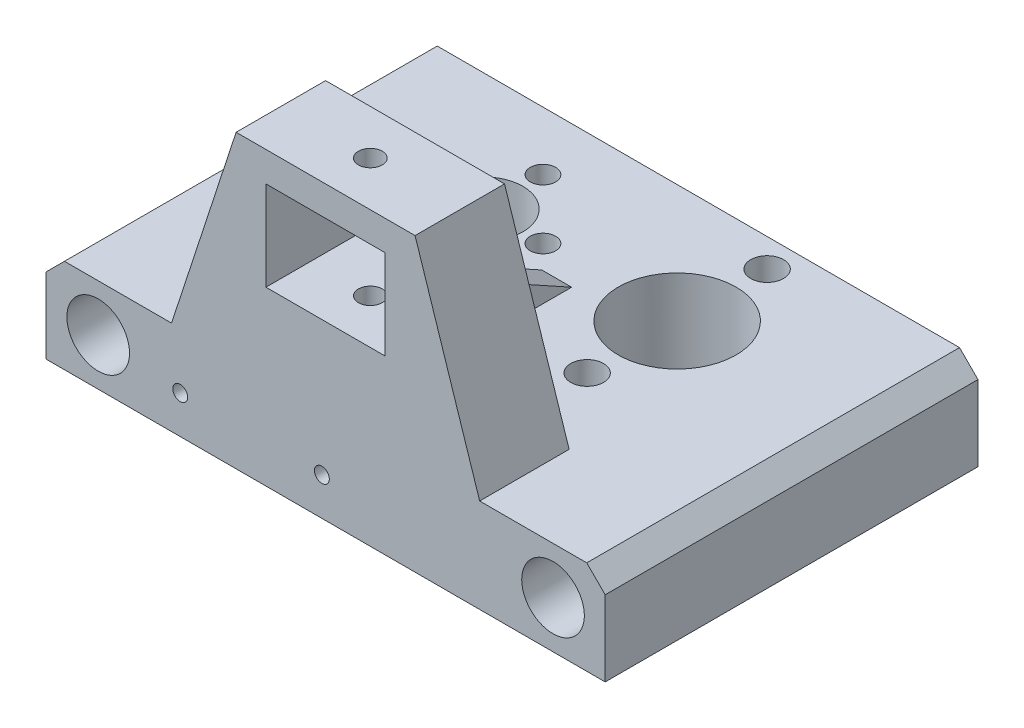
ISO-10303-21;
HEADER;
FILE_DESCRIPTION(('STEP AP214'),'2;1');
FILE_NAME('part.step','',(''),(''),'','','');
FILE_SCHEMA(('AUTOMOTIVE_DESIGN { 1 0 10303 214 1 1 1 1 }'));
ENDSEC;
DATA;
#1=APPLICATION_CONTEXT('core data for automotive mechanical design processes');
#2=APPLICATION_PROTOCOL_DEFINITION('international standard','automotive_design',2000,#1);
#3=PRODUCT_CONTEXT('',#1,'mechanical');
#4=PRODUCT('Part','Part','',(#3));
#5=PRODUCT_RELATED_PRODUCT_CATEGORY('part','',(#4));
#6=PRODUCT_DEFINITION_FORMATION('','',#4);
#7=PRODUCT_DEFINITION_CONTEXT('part definition',#1,'design');
#8=PRODUCT_DEFINITION('design','',#6,#7);
#9=PRODUCT_DEFINITION_SHAPE('','',#8);
#10=(LENGTH_UNIT() NAMED_UNIT(*) SI_UNIT(.MILLI.,.METRE.));
#11=(NAMED_UNIT(*) PLANE_ANGLE_UNIT() SI_UNIT($,.RADIAN.));
#12=(NAMED_UNIT(*) SI_UNIT($,.STERADIAN.) SOLID_ANGLE_UNIT());
#13=UNCERTAINTY_MEASURE_WITH_UNIT(LENGTH_MEASURE(1.E-05),#10,'distance_accuracy_value','');
#14=(GEOMETRIC_REPRESENTATION_CONTEXT(3) GLOBAL_UNCERTAINTY_ASSIGNED_CONTEXT((#13)) GLOBAL_UNIT_ASSIGNED_CONTEXT((#10,
#11,#12)) REPRESENTATION_CONTEXT('',''));
#15=CARTESIAN_POINT('',(0.,0.,0.));
#16=DIRECTION('',(0.,0.,1.));
#17=DIRECTION('',(1.,0.,0.));
#18=AXIS2_PLACEMENT_3D('',#15,#16,#17);
#19=CARTESIAN_POINT('',(35.5,2.1,-12.));
#20=DIRECTION('',(1.,0.,0.));
#21=DIRECTION('',(0.,0.,-1.));
#22=AXIS2_PLACEMENT_3D('',#19,#20,#21);
#23=PLANE('',#22);
#24=DIRECTION('',(0.,0.,-1.));
#25=VECTOR('',#24,1.);
#26=CARTESIAN_POINT('',(35.5,12.6,-12.));
#27=LINE('',#26,#25);
#28=CARTESIAN_POINT('',(35.5,12.6,-12.));
#29=VERTEX_POINT('',#28);
#30=CARTESIAN_POINT('',(35.5,12.6,-31.));
#31=VERTEX_POINT('',#30);
#32=EDGE_CURVE('E194',#29,#31,#27,.T.);
#33=ORIENTED_EDGE('',*,*,#32,.F.);
#34=DIRECTION('',(0.,-1.,0.));
#35=VECTOR('',#34,1.);
#36=CARTESIAN_POINT('',(35.5,2.1,-12.));
#37=LINE('',#36,#35);
#38=CARTESIAN_POINT('',(35.5,23.1,-12.));
#39=VERTEX_POINT('',#38);
#40=EDGE_CURVE('E212',#39,#29,#37,.T.);
#41=ORIENTED_EDGE('',*,*,#40,.F.);
#42=DIRECTION('',(0.,-0.483686111690123,-0.87524153543927));
#43=VECTOR('',#42,1.);
#44=CARTESIAN_POINT('',(35.5,23.1,-12.));
#45=LINE('',#44,#43);
#46=EDGE_CURVE('E202',#39,#31,#45,.T.);
#47=ORIENTED_EDGE('',*,*,#46,.T.);
#48=EDGE_LOOP('',(#33,#41,#47));
#49=FACE_BOUND('',#48,.T.);
#50=ADVANCED_FACE('F34',(#49),#23,.F.);
#51=CARTESIAN_POINT('',(45.5,35.1,-12.));
#52=DIRECTION('',(0.,0.,1.));
#53=DIRECTION('',(1.,0.,0.));
#54=AXIS2_PLACEMENT_3D('',#51,#52,#53);
#55=PLANE('',#54);
#56=DIRECTION('',(1.,0.,0.));
#57=VECTOR('',#56,1.);
#58=CARTESIAN_POINT('',(45.5,12.6,-12.));
#59=LINE('',#58,#57);
#60=CARTESIAN_POINT('',(16.8365384615385,12.6,-12.));
#61=VERTEX_POINT('',#60);
#62=EDGE_CURVE('E195',#61,#29,#59,.T.);
#63=ORIENTED_EDGE('',*,*,#62,.F.);
#64=DIRECTION('',(0.310738856307423,0.950495325175645,0.));
#65=VECTOR('',#64,1.);
#66=CARTESIAN_POINT('',(25.5,39.1,-12.));
#67=LINE('',#66,#65);
#68=CARTESIAN_POINT('',(25.5,39.1,-12.));
#69=VERTEX_POINT('',#68);
#70=EDGE_CURVE('E226',#61,#69,#67,.T.);
#71=ORIENTED_EDGE('',*,*,#70,.T.);
#72=DIRECTION('',(1.,0.,0.));
#73=VECTOR('',#72,1.);
#74=CARTESIAN_POINT('',(49.5,39.1,-12.));
#75=LINE('',#74,#73);
#76=CARTESIAN_POINT('',(49.5,39.1,-12.));
#77=VERTEX_POINT('',#76);
#78=EDGE_CURVE('E271',#69,#77,#75,.T.);
#79=ORIENTED_EDGE('',*,*,#78,.T.);
#80=DIRECTION('',(0.310738856307423,-0.950495325175645,0.));
#81=VECTOR('',#80,1.);
#82=CARTESIAN_POINT('',(49.5,39.1,-12.));
#83=LINE('',#82,#81);
#84=CARTESIAN_POINT('',(58.1634615384615,12.6,-12.));
#85=VERTEX_POINT('',#84);
#86=EDGE_CURVE('E231',#77,#85,#83,.T.);
#87=ORIENTED_EDGE('',*,*,#86,.T.);
#88=CARTESIAN_POINT('',(39.5,12.6,-12.));
#89=VERTEX_POINT('',#88);
#90=EDGE_CURVE('E192',#89,#85,#59,.T.);
#91=ORIENTED_EDGE('',*,*,#90,.F.);
#92=DIRECTION('',(0.,-1.,0.));
#93=VECTOR('',#92,1.);
#94=CARTESIAN_POINT('',(39.5,2.1,-12.));
#95=LINE('',#94,#93);
#96=CARTESIAN_POINT('',(39.5,23.1,-12.));
#97=VERTEX_POINT('',#96);
#98=EDGE_CURVE('E205',#97,#89,#95,.T.);
#99=ORIENTED_EDGE('',*,*,#98,.F.);
#100=DIRECTION('',(-1.,0.,0.));
#101=VECTOR('',#100,1.);
#102=CARTESIAN_POINT('',(45.5,23.1,-12.));
#103=LINE('',#102,#101);
#104=CARTESIAN_POINT('',(45.5,23.1,-12.));
#105=VERTEX_POINT('',#104);
#106=EDGE_CURVE('E239',#105,#97,#103,.T.);
#107=ORIENTED_EDGE('',*,*,#106,.F.);
#108=DIRECTION('',(0.,-1.,0.));
#109=VECTOR('',#108,1.);
#110=CARTESIAN_POINT('',(45.5,35.1,-12.));
#111=LINE('',#110,#109);
#112=CARTESIAN_POINT('',(45.5,35.1,-12.));
#113=VERTEX_POINT('',#112);
#114=EDGE_CURVE('E293',#113,#105,#111,.T.);
#115=ORIENTED_EDGE('',*,*,#114,.F.);
#116=DIRECTION('',(-1.,0.,0.));
#117=VECTOR('',#116,1.);
#118=CARTESIAN_POINT('',(49.5,35.1,-12.));
#119=LINE('',#118,#117);
#120=CARTESIAN_POINT('',(29.5,35.1,-12.));
#121=VERTEX_POINT('',#120);
#122=EDGE_CURVE('E250',#113,#121,#119,.T.);
#123=ORIENTED_EDGE('',*,*,#122,.T.);
#124=DIRECTION('',(0.,-1.,0.));
#125=VECTOR('',#124,1.);
#126=CARTESIAN_POINT('',(29.5,35.1,-12.));
#127=LINE('',#126,#125);
#128=CARTESIAN_POINT('',(29.5,23.1,-12.));
#129=VERTEX_POINT('',#128);
#130=EDGE_CURVE('E284',#121,#129,#127,.T.);
#131=ORIENTED_EDGE('',*,*,#130,.T.);
#132=EDGE_CURVE('E238',#39,#129,#103,.T.);
#133=ORIENTED_EDGE('',*,*,#132,.F.);
#134=ORIENTED_EDGE('',*,*,#40,.T.);
#135=EDGE_LOOP('',(#63,#71,#79,#87,#91,#99,#107,#115,#123,#131,#133,#134));
#136=FACE_BOUND('',#135,.T.);
#137=ADVANCED_FACE('F344',(#136),#55,.F.);
#138=CARTESIAN_POINT('',(49.5,39.1,-53.0312380997698));
#139=DIRECTION('',(0.950495325175645,0.310738856307423,0.));
#140=DIRECTION('',(-0.310738856307423,0.950495325175645,0.));
#141=AXIS2_PLACEMENT_3D('',#138,#139,#140);
#142=PLANE('',#141);
#143=DIRECTION('',(-0.310738856307422,0.950495325175645,0.));
#144=VECTOR('',#143,1.);
#145=CARTESIAN_POINT('',(49.5,39.1,0.));
#146=LINE('',#145,#144);
#147=CARTESIAN_POINT('',(58.1634615384615,12.6,0.));
#148=VERTEX_POINT('',#147);
#149=CARTESIAN_POINT('',(49.5,39.1,0.));
#150=VERTEX_POINT('',#149);
#151=EDGE_CURVE('E228',#148,#150,#146,.T.);
#152=ORIENTED_EDGE('',*,*,#151,.F.);
#153=DIRECTION('',(0.,0.,-1.));
#154=VECTOR('',#153,1.);
#155=CARTESIAN_POINT('',(58.1634615384615,12.6,-53.0312380997698));
#156=LINE('',#155,#154);
#157=EDGE_CURVE('E173',#148,#85,#156,.T.);
#158=ORIENTED_EDGE('',*,*,#157,.T.);
#159=ORIENTED_EDGE('',*,*,#86,.F.);
#160=DIRECTION('',(0.,0.,-1.));
#161=VECTOR('',#160,1.);
#162=CARTESIAN_POINT('',(49.5,39.1,24.3310501211929));
#163=LINE('',#162,#161);
#164=EDGE_CURVE('E268',#150,#77,#163,.T.);
#165=ORIENTED_EDGE('',*,*,#164,.F.);
#166=EDGE_LOOP('',(#152,#158,#159,#165));
#167=FACE_BOUND('',#166,.T.);
#168=ADVANCED_FACE('F381',(#167),#142,.T.);
#169=CARTESIAN_POINT('',(25.5,39.1,-53.0312380997698));
#170=DIRECTION('',(-0.950495325175645,0.310738856307423,0.));
#171=DIRECTION('',(-0.310738856307423,-0.950495325175645,0.));
#172=AXIS2_PLACEMENT_3D('',#169,#170,#171);
#173=PLANE('',#172);
#174=ORIENTED_EDGE('',*,*,#70,.F.);
#175=DIRECTION('',(0.,0.,1.));
#176=VECTOR('',#175,1.);
#177=CARTESIAN_POINT('',(16.8365384615385,12.6,-53.0312380997698));
#178=LINE('',#177,#176);
#179=CARTESIAN_POINT('',(16.8365384615385,12.6,0.));
#180=VERTEX_POINT('',#179);
#181=EDGE_CURVE('E198',#61,#180,#178,.T.);
#182=ORIENTED_EDGE('',*,*,#181,.T.);
#183=DIRECTION('',(-0.310738856307422,-0.950495325175645,0.));
#184=VECTOR('',#183,1.);
#185=CARTESIAN_POINT('',(25.5,39.1,0.));
#186=LINE('',#185,#184);
#187=CARTESIAN_POINT('',(25.5,39.1,0.));
#188=VERTEX_POINT('',#187);
#189=EDGE_CURVE('E225',#188,#180,#186,.T.);
#190=ORIENTED_EDGE('',*,*,#189,.F.);
#191=DIRECTION('',(0.,0.,-1.));
#192=VECTOR('',#191,1.);
#193=CARTESIAN_POINT('',(25.5,39.1,24.3310501211929));
#194=LINE('',#193,#192);
#195=EDGE_CURVE('E274',#188,#69,#194,.T.);
#196=ORIENTED_EDGE('',*,*,#195,.T.);
#197=EDGE_LOOP('',(#174,#182,#190,#196));
#198=FACE_BOUND('',#197,.T.);
#199=ADVANCED_FACE('F389',(#198),#173,.T.);
#200=CARTESIAN_POINT('',(39.5,2.1,-12.));
#201=DIRECTION('',(-1.,0.,0.));
#202=DIRECTION('',(0.,0.,1.));
#203=AXIS2_PLACEMENT_3D('',#200,#201,#202);
#204=PLANE('',#203);
#205=DIRECTION('',(0.,0.,1.));
#206=VECTOR('',#205,1.);
#207=CARTESIAN_POINT('',(39.5,12.6,-12.));
#208=LINE('',#207,#206);
#209=CARTESIAN_POINT('',(39.5,12.6,-31.));
#210=VERTEX_POINT('',#209);
#211=EDGE_CURVE('E190',#210,#89,#208,.T.);
#212=ORIENTED_EDGE('',*,*,#211,.F.);
#213=DIRECTION('',(0.,0.483686111690123,0.87524153543927));
#214=VECTOR('',#213,1.);
#215=CARTESIAN_POINT('',(39.5,23.1,-12.));
#216=LINE('',#215,#214);
#217=EDGE_CURVE('E201',#210,#97,#216,.T.);
#218=ORIENTED_EDGE('',*,*,#217,.T.);
#219=ORIENTED_EDGE('',*,*,#98,.T.);
#220=EDGE_LOOP('',(#212,#218,#219));
#221=FACE_BOUND('',#220,.T.);
#222=ADVANCED_FACE('F349',(#221),#204,.F.);
#223=CARTESIAN_POINT('',(-7.91658669218481,23.1,-12.));
#224=DIRECTION('',(0.,0.87524153543927,-0.483686111690123));
#225=DIRECTION('',(0.,0.483686111690123,0.87524153543927));
#226=AXIS2_PLACEMENT_3D('',#223,#224,#225);
#227=PLANE('',#226);
#228=ORIENTED_EDGE('',*,*,#217,.F.);
#229=DIRECTION('',(-1.,0.,0.));
#230=VECTOR('',#229,1.);
#231=CARTESIAN_POINT('',(-7.91658669218482,12.6,-31.));
#232=LINE('',#231,#230);
#233=EDGE_CURVE('E11',#210,#31,#232,.T.);
#234=ORIENTED_EDGE('',*,*,#233,.T.);
#235=ORIENTED_EDGE('',*,*,#46,.F.);
#236=DIRECTION('',(1.,0.,0.));
#237=VECTOR('',#236,1.);
#238=CARTESIAN_POINT('',(-7.91658669218481,23.1,-12.));
#239=LINE('',#238,#237);
#240=EDGE_CURVE('E206',#39,#97,#239,.T.);
#241=ORIENTED_EDGE('',*,*,#240,.T.);
#242=EDGE_LOOP('',(#228,#234,#235,#241));
#243=FACE_BOUND('',#242,.T.);
#244=ADVANCED_FACE('F352',(#243),#227,.T.);
#245=CARTESIAN_POINT('',(0.,0.,0.));
#246=DIRECTION('',(0.,-1.,0.));
#247=DIRECTION('',(0.,0.,-1.));
#248=AXIS2_PLACEMENT_3D('',#245,#246,#247);
#249=PLANE('',#248);
#250=CARTESIAN_POINT('',(50.4999999999999,0.,-22.08));
#251=DIRECTION('',(0.,1.,0.));
#252=DIRECTION('',(0.,0.,1.));
#253=AXIS2_PLACEMENT_3D('',#250,#251,#252);
#254=CIRCLE('',#253,2.2);
#255=CARTESIAN_POINT('',(50.4999999999999,0.,-19.88));
#256=VERTEX_POINT('',#255);
#257=EDGE_CURVE('E247',#256,#256,#254,.T.);
#258=ORIENTED_EDGE('',*,*,#257,.T.);
#259=EDGE_LOOP('',(#258));
#260=FACE_BOUND('',#259,.T.);
#261=CARTESIAN_POINT('',(50.4999999999999,0.,-46.215));
#262=DIRECTION('',(0.,1.,0.));
#263=DIRECTION('',(0.,0.,1.));
#264=AXIS2_PLACEMENT_3D('',#261,#262,#263);
#265=CIRCLE('',#264,2.2);
#266=CARTESIAN_POINT('',(50.4999999999999,0.,-44.015));
#267=VERTEX_POINT('',#266);
#268=EDGE_CURVE('E251',#267,#267,#265,.T.);
#269=ORIENTED_EDGE('',*,*,#268,.T.);
#270=EDGE_LOOP('',(#269));
#271=FACE_BOUND('',#270,.T.);
#272=CARTESIAN_POINT('',(24.4999999999999,0.,-42.15));
#273=DIRECTION('',(0.,1.,0.));
#274=DIRECTION('',(0.,0.,1.));
#275=AXIS2_PLACEMENT_3D('',#272,#273,#274);
#276=CIRCLE('',#275,1.7);
#277=CARTESIAN_POINT('',(24.4999999999999,0.,-40.45));
#278=VERTEX_POINT('',#277);
#279=EDGE_CURVE('E254',#278,#278,#276,.T.);
#280=ORIENTED_EDGE('',*,*,#279,.T.);
#281=EDGE_LOOP('',(#280));
#282=FACE_BOUND('',#281,.T.);
#283=CARTESIAN_POINT('',(16.4999999999999,0.,-34.15));
#284=DIRECTION('',(0.,1.,0.));
#285=DIRECTION('',(0.,0.,1.));
#286=AXIS2_PLACEMENT_3D('',#283,#284,#285);
#287=CIRCLE('',#286,1.7);
#288=CARTESIAN_POINT('',(16.4999999999999,0.,-32.45));
#289=VERTEX_POINT('',#288);
#290=EDGE_CURVE('E257',#289,#289,#287,.T.);
#291=ORIENTED_EDGE('',*,*,#290,.T.);
#292=EDGE_LOOP('',(#291));
#293=FACE_BOUND('',#292,.T.);
#294=CARTESIAN_POINT('',(32.4999999999999,0.,-34.15));
#295=DIRECTION('',(0.,1.,0.));
#296=DIRECTION('',(0.,0.,-1.));
#297=AXIS2_PLACEMENT_3D('',#294,#295,#296);
#298=CIRCLE('',#297,1.7);
#299=CARTESIAN_POINT('',(32.4999999999999,0.,-35.85));
#300=VERTEX_POINT('',#299);
#301=EDGE_CURVE('E260',#300,#300,#298,.T.);
#302=ORIENTED_EDGE('',*,*,#301,.T.);
#303=EDGE_LOOP('',(#302));
#304=FACE_BOUND('',#303,.T.);
#305=CARTESIAN_POINT('',(24.4999999999999,0.,-26.15));
#306=DIRECTION('',(0.,1.,0.));
#307=DIRECTION('',(0.,0.,-1.));
#308=AXIS2_PLACEMENT_3D('',#305,#306,#307);
#309=CIRCLE('',#308,1.7);
#310=CARTESIAN_POINT('',(24.4999999999999,0.,-27.85));
#311=VERTEX_POINT('',#310);
#312=EDGE_CURVE('E246',#311,#311,#309,.T.);
#313=ORIENTED_EDGE('',*,*,#312,.T.);
#314=EDGE_LOOP('',(#313));
#315=FACE_BOUND('',#314,.T.);
#316=CARTESIAN_POINT('',(24.4999999999999,0.,-34.15));
#317=DIRECTION('',(0.,1.,0.));
#318=DIRECTION('',(0.,0.,1.));
#319=AXIS2_PLACEMENT_3D('',#316,#317,#318);
#320=CIRCLE('',#319,5.3);
#321=CARTESIAN_POINT('',(24.4999999999999,0.,-28.85));
#322=VERTEX_POINT('',#321);
#323=EDGE_CURVE('E304',#322,#322,#320,.T.);
#324=ORIENTED_EDGE('',*,*,#323,.T.);
#325=EDGE_LOOP('',(#324));
#326=FACE_BOUND('',#325,.T.);
#327=DIRECTION('',(0.,0.,1.));
#328=VECTOR('',#327,1.);
#329=CARTESIAN_POINT('',(0.,0.,0.));
#330=LINE('',#329,#328);
#331=CARTESIAN_POINT('',(0.,0.,-50.));
#332=VERTEX_POINT('',#331);
#333=CARTESIAN_POINT('',(0.,0.,0.));
#334=VERTEX_POINT('',#333);
#335=EDGE_CURVE('E307',#332,#334,#330,.T.);
#336=ORIENTED_EDGE('',*,*,#335,.F.);
#337=DIRECTION('',(-1.,0.,0.));
#338=VECTOR('',#337,1.);
#339=CARTESIAN_POINT('',(0.,0.,-50.));
#340=LINE('',#339,#338);
#341=CARTESIAN_POINT('',(75.,0.,-50.));
#342=VERTEX_POINT('',#341);
#343=EDGE_CURVE('E315',#342,#332,#340,.T.);
#344=ORIENTED_EDGE('',*,*,#343,.F.);
#345=DIRECTION('',(0.,0.,-1.));
#346=VECTOR('',#345,1.);
#347=CARTESIAN_POINT('',(75.,0.,0.));
#348=LINE('',#347,#346);
#349=CARTESIAN_POINT('',(75.,0.,0.));
#350=VERTEX_POINT('',#349);
#351=EDGE_CURVE('E312',#350,#342,#348,.T.);
#352=ORIENTED_EDGE('',*,*,#351,.F.);
#353=DIRECTION('',(1.,0.,0.));
#354=VECTOR('',#353,1.);
#355=CARTESIAN_POINT('',(0.,0.,0.));
#356=LINE('',#355,#354);
#357=EDGE_CURVE('E310',#334,#350,#356,.T.);
#358=ORIENTED_EDGE('',*,*,#357,.F.);
#359=EDGE_LOOP('',(#336,#344,#352,#358));
#360=FACE_BOUND('',#359,.T.);
#361=CARTESIAN_POINT('',(50.4999999999999,0.,-34.15));
#362=DIRECTION('',(0.,1.,0.));
#363=DIRECTION('',(0.,0.,1.));
#364=AXIS2_PLACEMENT_3D('',#361,#362,#363);
#365=CIRCLE('',#364,7.9);
#366=CARTESIAN_POINT('',(50.4999999999999,0.,-26.25));
#367=VERTEX_POINT('',#366);
#368=EDGE_CURVE('E301',#367,#367,#365,.T.);
#369=ORIENTED_EDGE('',*,*,#368,.T.);
#370=EDGE_LOOP('',(#369));
#371=FACE_BOUND('',#370,.T.);
#372=ADVANCED_FACE('F524',(#260,#271,#282,#293,#304,#315,#326,#360,#371),#249,.T.);
#373=CARTESIAN_POINT('',(0.,0.1,0.));
#374=DIRECTION('',(1.,0.,0.));
#375=DIRECTION('',(0.,0.,-1.));
#376=AXIS2_PLACEMENT_3D('',#373,#374,#375);
#377=PLANE('',#376);
#378=DIRECTION('',(0.,-1.,0.));
#379=VECTOR('',#378,1.);
#380=CARTESIAN_POINT('',(0.,0.1,0.));
#381=LINE('',#380,#379);
#382=CARTESIAN_POINT('',(0.,10.1251262658471,0.));
#383=VERTEX_POINT('',#382);
#384=EDGE_CURVE('E42',#383,#334,#381,.T.);
#385=ORIENTED_EDGE('',*,*,#384,.F.);
#386=DIRECTION('',(0.,0.,-1.));
#387=VECTOR('',#386,1.);
#388=CARTESIAN_POINT('',(0.,10.1251262658471,0.));
#389=LINE('',#388,#387);
#390=CARTESIAN_POINT('',(0.,10.1251262658471,-50.));
#391=VERTEX_POINT('',#390);
#392=EDGE_CURVE('E451',#383,#391,#389,.T.);
#393=ORIENTED_EDGE('',*,*,#392,.T.);
#394=DIRECTION('',(0.,-1.,0.));
#395=VECTOR('',#394,1.);
#396=CARTESIAN_POINT('',(0.,0.1,-50.));
#397=LINE('',#396,#395);
#398=EDGE_CURVE('E318',#391,#332,#397,.T.);
#399=ORIENTED_EDGE('',*,*,#398,.T.);
#400=ORIENTED_EDGE('',*,*,#335,.T.);
#401=EDGE_LOOP('',(#385,#393,#399,#400));
#402=FACE_BOUND('',#401,.T.);
#403=ADVANCED_FACE('F36',(#402),#377,.F.);
#404=CARTESIAN_POINT('',(0.,0.1,0.));
#405=DIRECTION('',(0.,0.,-1.));
#406=DIRECTION('',(-1.,0.,0.));
#407=AXIS2_PLACEMENT_3D('',#404,#405,#406);
#408=PLANE('',#407);
#409=CARTESIAN_POINT('',(18.,5.06256313292354,0.));
#410=DIRECTION('',(0.,0.,1.));
#411=DIRECTION('',(1.,0.,0.));
#412=AXIS2_PLACEMENT_3D('',#409,#410,#411);
#413=CIRCLE('',#412,1.);
#414=CARTESIAN_POINT('',(19.,5.06256313292354,0.));
#415=VERTEX_POINT('',#414);
#416=EDGE_CURVE('E472',#415,#415,#413,.T.);
#417=ORIENTED_EDGE('',*,*,#416,.F.);
#418=EDGE_LOOP('',(#417));
#419=FACE_BOUND('',#418,.T.);
#420=CARTESIAN_POINT('',(37.,5.06256313292354,0.));
#421=DIRECTION('',(0.,0.,1.));
#422=DIRECTION('',(1.,0.,0.));
#423=AXIS2_PLACEMENT_3D('',#420,#421,#422);
#424=CIRCLE('',#423,0.999999999999998);
#425=CARTESIAN_POINT('',(38.,5.06256313292354,0.));
#426=VERTEX_POINT('',#425);
#427=EDGE_CURVE('E466',#426,#426,#424,.T.);
#428=ORIENTED_EDGE('',*,*,#427,.F.);
#429=EDGE_LOOP('',(#428));
#430=FACE_BOUND('',#429,.T.);
#431=CARTESIAN_POINT('',(6.99999999999999,6.3,0.));
#432=DIRECTION('',(0.,0.,-1.));
#433=DIRECTION('',(1.,0.,0.));
#434=AXIS2_PLACEMENT_3D('',#431,#432,#433);
#435=CIRCLE('',#434,4.2);
#436=CARTESIAN_POINT('',(11.2,6.3,0.));
#437=VERTEX_POINT('',#436);
#438=EDGE_CURVE('E456',#437,#437,#435,.T.);
#439=ORIENTED_EDGE('',*,*,#438,.T.);
#440=EDGE_LOOP('',(#439));
#441=FACE_BOUND('',#440,.T.);
#442=CARTESIAN_POINT('',(68.,6.3,0.));
#443=DIRECTION('',(0.,0.,-1.));
#444=DIRECTION('',(-1.,0.,0.));
#445=AXIS2_PLACEMENT_3D('',#442,#443,#444);
#446=CIRCLE('',#445,4.19999999999999);
#447=CARTESIAN_POINT('',(63.8,6.3,0.));
#448=VERTEX_POINT('',#447);
#449=EDGE_CURVE('E182',#448,#448,#446,.T.);
#450=ORIENTED_EDGE('',*,*,#449,.T.);
#451=EDGE_LOOP('',(#450));
#452=FACE_BOUND('',#451,.T.);
#453=DIRECTION('',(0.,-1.,0.));
#454=VECTOR('',#453,1.);
#455=CARTESIAN_POINT('',(75.,0.1,0.));
#456=LINE('',#455,#454);
#457=CARTESIAN_POINT('',(75.,10.1251262658471,0.));
#458=VERTEX_POINT('',#457);
#459=EDGE_CURVE('E168',#458,#350,#456,.T.);
#460=ORIENTED_EDGE('',*,*,#459,.F.);
#461=DIRECTION('',(-0.707106781186548,0.707106781186547,0.));
#462=VECTOR('',#461,1.);
#463=CARTESIAN_POINT('',(75.,10.1251262658471,0.));
#464=LINE('',#463,#462);
#465=CARTESIAN_POINT('',(72.5251262658471,12.6,0.));
#466=VERTEX_POINT('',#465);
#467=EDGE_CURVE('E153',#458,#466,#464,.T.);
#468=ORIENTED_EDGE('',*,*,#467,.T.);
#469=DIRECTION('',(-1.,0.,0.));
#470=VECTOR('',#469,1.);
#471=CARTESIAN_POINT('',(0.,12.6,0.));
#472=LINE('',#471,#470);
#473=EDGE_CURVE('E165',#466,#148,#472,.T.);
#474=ORIENTED_EDGE('',*,*,#473,.T.);
#475=ORIENTED_EDGE('',*,*,#151,.T.);
#476=DIRECTION('',(-1.,0.,0.));
#477=VECTOR('',#476,1.);
#478=CARTESIAN_POINT('',(49.5,39.1,0.));
#479=LINE('',#478,#477);
#480=EDGE_CURVE('E265',#150,#188,#479,.T.);
#481=ORIENTED_EDGE('',*,*,#480,.T.);
#482=ORIENTED_EDGE('',*,*,#189,.T.);
#483=CARTESIAN_POINT('',(2.47487373415292,12.6,0.));
#484=VERTEX_POINT('',#483);
#485=EDGE_CURVE('E176',#180,#484,#472,.T.);
#486=ORIENTED_EDGE('',*,*,#485,.T.);
#487=DIRECTION('',(-0.707106781186548,-0.707106781186547,0.));
#488=VECTOR('',#487,1.);
#489=CARTESIAN_POINT('',(0.,10.1251262658471,0.));
#490=LINE('',#489,#488);
#491=EDGE_CURVE('E49',#484,#383,#490,.T.);
#492=ORIENTED_EDGE('',*,*,#491,.T.);
#493=ORIENTED_EDGE('',*,*,#384,.T.);
#494=ORIENTED_EDGE('',*,*,#357,.T.);
#495=EDGE_LOOP('',(#460,#468,#474,#475,#481,#482,#486,#492,#493,#494));
#496=FACE_BOUND('',#495,.T.);
#497=DIRECTION('',(1.,0.,0.));
#498=VECTOR('',#497,1.);
#499=CARTESIAN_POINT('',(49.5,35.1,0.));
#500=LINE('',#499,#498);
#501=CARTESIAN_POINT('',(29.5,35.1,0.));
#502=VERTEX_POINT('',#501);
#503=CARTESIAN_POINT('',(45.5,35.1,0.));
#504=VERTEX_POINT('',#503);
#505=EDGE_CURVE('E267',#502,#504,#500,.T.);
#506=ORIENTED_EDGE('',*,*,#505,.T.);
#507=DIRECTION('',(0.,-1.,0.));
#508=VECTOR('',#507,1.);
#509=CARTESIAN_POINT('',(45.5,35.1,0.));
#510=LINE('',#509,#508);
#511=CARTESIAN_POINT('',(45.5,23.1,0.));
#512=VERTEX_POINT('',#511);
#513=EDGE_CURVE('E296',#504,#512,#510,.T.);
#514=ORIENTED_EDGE('',*,*,#513,.T.);
#515=DIRECTION('',(1.,0.,0.));
#516=VECTOR('',#515,1.);
#517=CARTESIAN_POINT('',(45.5,23.1,0.));
#518=LINE('',#517,#516);
#519=CARTESIAN_POINT('',(29.5,23.1,0.));
#520=VERTEX_POINT('',#519);
#521=EDGE_CURVE('E244',#520,#512,#518,.T.);
#522=ORIENTED_EDGE('',*,*,#521,.F.);
#523=DIRECTION('',(0.,-1.,0.));
#524=VECTOR('',#523,1.);
#525=CARTESIAN_POINT('',(29.5,35.1,0.));
#526=LINE('',#525,#524);
#527=EDGE_CURVE('E287',#502,#520,#526,.T.);
#528=ORIENTED_EDGE('',*,*,#527,.F.);
#529=EDGE_LOOP('',(#506,#514,#522,#528));
#530=FACE_BOUND('',#529,.T.);
#531=ADVANCED_FACE('F163',(#419,#430,#441,#452,#496,#530),#408,.F.);
#532=CARTESIAN_POINT('',(75.,0.1,0.));
#533=DIRECTION('',(-1.,0.,0.));
#534=DIRECTION('',(0.,0.,1.));
#535=AXIS2_PLACEMENT_3D('',#532,#533,#534);
#536=PLANE('',#535);
#537=DIRECTION('',(0.,-1.,0.));
#538=VECTOR('',#537,1.);
#539=CARTESIAN_POINT('',(75.,0.1,-50.));
#540=LINE('',#539,#538);
#541=CARTESIAN_POINT('',(75.,10.1251262658471,-50.));
#542=VERTEX_POINT('',#541);
#543=EDGE_CURVE('E320',#542,#342,#540,.T.);
#544=ORIENTED_EDGE('',*,*,#543,.F.);
#545=DIRECTION('',(0.,0.,-1.));
#546=VECTOR('',#545,1.);
#547=CARTESIAN_POINT('',(75.,10.1251262658471,0.));
#548=LINE('',#547,#546);
#549=EDGE_CURVE('E159',#458,#542,#548,.T.);
#550=ORIENTED_EDGE('',*,*,#549,.F.);
#551=ORIENTED_EDGE('',*,*,#459,.T.);
#552=ORIENTED_EDGE('',*,*,#351,.T.);
#553=EDGE_LOOP('',(#544,#550,#551,#552));
#554=FACE_BOUND('',#553,.T.);
#555=ADVANCED_FACE('F489',(#554),#536,.F.);
#556=CARTESIAN_POINT('',(0.,0.1,-50.));
#557=DIRECTION('',(0.,0.,1.));
#558=DIRECTION('',(1.,0.,0.));
#559=AXIS2_PLACEMENT_3D('',#556,#557,#558);
#560=PLANE('',#559);
#561=CARTESIAN_POINT('',(6.99999999999999,6.3,-50.));
#562=DIRECTION('',(0.,0.,-1.));
#563=DIRECTION('',(1.,0.,0.));
#564=AXIS2_PLACEMENT_3D('',#561,#562,#563);
#565=CIRCLE('',#564,4.2);
#566=CARTESIAN_POINT('',(11.2,6.3,-50.));
#567=VERTEX_POINT('',#566);
#568=EDGE_CURVE('E460',#567,#567,#565,.T.);
#569=ORIENTED_EDGE('',*,*,#568,.F.);
#570=EDGE_LOOP('',(#569));
#571=FACE_BOUND('',#570,.T.);
#572=CARTESIAN_POINT('',(68.,6.3,-50.));
#573=DIRECTION('',(0.,0.,-1.));
#574=DIRECTION('',(-1.,0.,0.));
#575=AXIS2_PLACEMENT_3D('',#572,#573,#574);
#576=CIRCLE('',#575,4.19999999999999);
#577=CARTESIAN_POINT('',(63.8,6.3,-50.));
#578=VERTEX_POINT('',#577);
#579=EDGE_CURVE('E444',#578,#578,#576,.T.);
#580=ORIENTED_EDGE('',*,*,#579,.F.);
#581=EDGE_LOOP('',(#580));
#582=FACE_BOUND('',#581,.T.);
#583=DIRECTION('',(-1.,0.,0.));
#584=VECTOR('',#583,1.);
#585=CARTESIAN_POINT('',(0.,12.6,-50.));
#586=LINE('',#585,#584);
#587=CARTESIAN_POINT('',(72.5251262658471,12.6,-50.));
#588=VERTEX_POINT('',#587);
#589=CARTESIAN_POINT('',(2.47487373415292,12.6,-50.));
#590=VERTEX_POINT('',#589);
#591=EDGE_CURVE('E299',#588,#590,#586,.T.);
#592=ORIENTED_EDGE('',*,*,#591,.F.);
#593=DIRECTION('',(-0.707106781186548,0.707106781186547,0.));
#594=VECTOR('',#593,1.);
#595=CARTESIAN_POINT('',(75.,10.1251262658471,-50.));
#596=LINE('',#595,#594);
#597=EDGE_CURVE('E57',#542,#588,#596,.T.);
#598=ORIENTED_EDGE('',*,*,#597,.F.);
#599=ORIENTED_EDGE('',*,*,#543,.T.);
#600=ORIENTED_EDGE('',*,*,#343,.T.);
#601=ORIENTED_EDGE('',*,*,#398,.F.);
#602=DIRECTION('',(-0.707106781186548,-0.707106781186547,0.));
#603=VECTOR('',#602,1.);
#604=CARTESIAN_POINT('',(0.,10.1251262658471,-50.));
#605=LINE('',#604,#603);
#606=EDGE_CURVE('E454',#590,#391,#605,.T.);
#607=ORIENTED_EDGE('',*,*,#606,.F.);
#608=EDGE_LOOP('',(#592,#598,#599,#600,#601,#607));
#609=FACE_BOUND('',#608,.T.);
#610=ADVANCED_FACE('F502',(#571,#582,#609),#560,.F.);
#611=CARTESIAN_POINT('',(24.4999999999999,0.1,-34.15));
#612=DIRECTION('',(0.,-1.,0.));
#613=DIRECTION('',(0.,0.,-1.));
#614=AXIS2_PLACEMENT_3D('',#611,#612,#613);
#615=CYLINDRICAL_SURFACE('',#614,5.3);
#616=ORIENTED_EDGE('',*,*,#323,.F.);
#617=EDGE_LOOP('',(#616));
#618=FACE_BOUND('',#617,.T.);
#619=CARTESIAN_POINT('',(24.4999999999999,12.6,-34.15));
#620=DIRECTION('',(0.,-1.,0.));
#621=DIRECTION('',(0.,0.,-1.));
#622=AXIS2_PLACEMENT_3D('',#619,#620,#621);
#623=CIRCLE('',#622,5.3);
#624=CARTESIAN_POINT('',(24.4999999999999,12.6,-39.45));
#625=VERTEX_POINT('',#624);
#626=EDGE_CURVE('E434',#625,#625,#623,.T.);
#627=ORIENTED_EDGE('',*,*,#626,.F.);
#628=EDGE_LOOP('',(#627));
#629=FACE_BOUND('',#628,.T.);
#630=ADVANCED_FACE('F505',(#618,#629),#615,.F.);
#631=CARTESIAN_POINT('',(50.4999999999999,0.1,-34.15));
#632=DIRECTION('',(0.,-1.,0.));
#633=DIRECTION('',(0.,0.,-1.));
#634=AXIS2_PLACEMENT_3D('',#631,#632,#633);
#635=CYLINDRICAL_SURFACE('',#634,7.9);
#636=ORIENTED_EDGE('',*,*,#368,.F.);
#637=EDGE_LOOP('',(#636));
#638=FACE_BOUND('',#637,.T.);
#639=CARTESIAN_POINT('',(50.4999999999999,12.6,-34.15));
#640=DIRECTION('',(0.,-1.,0.));
#641=DIRECTION('',(0.,0.,-1.));
#642=AXIS2_PLACEMENT_3D('',#639,#640,#641);
#643=CIRCLE('',#642,7.9);
#644=CARTESIAN_POINT('',(50.4999999999999,12.6,-42.05));
#645=VERTEX_POINT('',#644);
#646=EDGE_CURVE('E179',#645,#645,#643,.F.);
#647=ORIENTED_EDGE('',*,*,#646,.T.);
#648=EDGE_LOOP('',(#647));
#649=FACE_BOUND('',#648,.T.);
#650=ADVANCED_FACE('F538',(#638,#649),#635,.F.);
#651=CARTESIAN_POINT('',(0.,12.6,0.));
#652=DIRECTION('',(0.,1.,0.));
#653=DIRECTION('',(0.,0.,1.));
#654=AXIS2_PLACEMENT_3D('',#651,#652,#653);
#655=PLANE('',#654);
#656=DIRECTION('',(0.,0.,-1.));
#657=VECTOR('',#656,1.);
#658=CARTESIAN_POINT('',(72.5251262658471,12.6,0.));
#659=LINE('',#658,#657);
#660=EDGE_CURVE('E150',#466,#588,#659,.T.);
#661=ORIENTED_EDGE('',*,*,#660,.T.);
#662=ORIENTED_EDGE('',*,*,#591,.T.);
#663=DIRECTION('',(0.,0.,-1.));
#664=VECTOR('',#663,1.);
#665=CARTESIAN_POINT('',(2.47487373415292,12.6,0.));
#666=LINE('',#665,#664);
#667=EDGE_CURVE('E449',#484,#590,#666,.T.);
#668=ORIENTED_EDGE('',*,*,#667,.F.);
#669=ORIENTED_EDGE('',*,*,#485,.F.);
#670=ORIENTED_EDGE('',*,*,#181,.F.);
#671=ORIENTED_EDGE('',*,*,#62,.T.);
#672=ORIENTED_EDGE('',*,*,#32,.T.);
#673=ORIENTED_EDGE('',*,*,#233,.F.);
#674=ORIENTED_EDGE('',*,*,#211,.T.);
#675=ORIENTED_EDGE('',*,*,#90,.T.);
#676=ORIENTED_EDGE('',*,*,#157,.F.);
#677=ORIENTED_EDGE('',*,*,#473,.F.);
#678=EDGE_LOOP('',(#661,#662,#668,#669,#670,#671,#672,#673,#674,#675,#676,#677));
#679=FACE_BOUND('',#678,.T.);
#680=ORIENTED_EDGE('',*,*,#626,.T.);
#681=EDGE_LOOP('',(#680));
#682=FACE_BOUND('',#681,.T.);
#683=CARTESIAN_POINT('',(16.4999999999999,12.6,-34.15));
#684=DIRECTION('',(0.,-1.,0.));
#685=DIRECTION('',(0.,0.,-1.));
#686=AXIS2_PLACEMENT_3D('',#683,#684,#685);
#687=CIRCLE('',#686,1.7);
#688=CARTESIAN_POINT('',(16.4999999999999,12.6,-35.85));
#689=VERTEX_POINT('',#688);
#690=EDGE_CURVE('E431',#689,#689,#687,.T.);
#691=ORIENTED_EDGE('',*,*,#690,.T.);
#692=EDGE_LOOP('',(#691));
#693=FACE_BOUND('',#692,.T.);
#694=CARTESIAN_POINT('',(24.4999999999999,12.6,-26.15));
#695=DIRECTION('',(0.,-1.,0.));
#696=DIRECTION('',(0.,0.,-1.));
#697=AXIS2_PLACEMENT_3D('',#694,#695,#696);
#698=CIRCLE('',#697,1.7);
#699=CARTESIAN_POINT('',(24.4999999999999,12.6,-27.85));
#700=VERTEX_POINT('',#699);
#701=EDGE_CURVE('E429',#700,#700,#698,.T.);
#702=ORIENTED_EDGE('',*,*,#701,.T.);
#703=EDGE_LOOP('',(#702));
#704=FACE_BOUND('',#703,.T.);
#705=CARTESIAN_POINT('',(24.4999999999999,12.6,-42.15));
#706=DIRECTION('',(0.,-1.,0.));
#707=DIRECTION('',(0.,0.,-1.));
#708=AXIS2_PLACEMENT_3D('',#705,#706,#707);
#709=CIRCLE('',#708,1.7);
#710=CARTESIAN_POINT('',(24.4999999999999,12.6,-43.85));
#711=VERTEX_POINT('',#710);
#712=EDGE_CURVE('E185',#711,#711,#709,.T.);
#713=ORIENTED_EDGE('',*,*,#712,.T.);
#714=EDGE_LOOP('',(#713));
#715=FACE_BOUND('',#714,.T.);
#716=ORIENTED_EDGE('',*,*,#646,.F.);
#717=EDGE_LOOP('',(#716));
#718=FACE_BOUND('',#717,.T.);
#719=CARTESIAN_POINT('',(32.4999999999999,12.6,-34.15));
#720=DIRECTION('',(0.,-1.,0.));
#721=DIRECTION('',(0.,0.,-1.));
#722=AXIS2_PLACEMENT_3D('',#719,#720,#721);
#723=CIRCLE('',#722,1.7);
#724=CARTESIAN_POINT('',(32.4999999999999,12.6,-35.85));
#725=VERTEX_POINT('',#724);
#726=EDGE_CURVE('E187',#725,#725,#723,.T.);
#727=ORIENTED_EDGE('',*,*,#726,.T.);
#728=EDGE_LOOP('',(#727));
#729=FACE_BOUND('',#728,.T.);
#730=CARTESIAN_POINT('',(50.4999999999999,12.6,-46.215));
#731=DIRECTION('',(0.,-1.,0.));
#732=DIRECTION('',(0.,0.,-1.));
#733=AXIS2_PLACEMENT_3D('',#730,#731,#732);
#734=CIRCLE('',#733,2.2);
#735=CARTESIAN_POINT('',(50.4999999999999,12.6,-48.415));
#736=VERTEX_POINT('',#735);
#737=EDGE_CURVE('E439',#736,#736,#734,.F.);
#738=ORIENTED_EDGE('',*,*,#737,.F.);
#739=EDGE_LOOP('',(#738));
#740=FACE_BOUND('',#739,.T.);
#741=CARTESIAN_POINT('',(50.4999999999999,12.6,-22.08));
#742=DIRECTION('',(0.,-1.,0.));
#743=DIRECTION('',(0.,0.,-1.));
#744=AXIS2_PLACEMENT_3D('',#741,#742,#743);
#745=CIRCLE('',#744,2.2);
#746=CARTESIAN_POINT('',(50.4999999999999,12.6,-24.28));
#747=VERTEX_POINT('',#746);
#748=EDGE_CURVE('E175',#747,#747,#745,.F.);
#749=ORIENTED_EDGE('',*,*,#748,.F.);
#750=EDGE_LOOP('',(#749));
#751=FACE_BOUND('',#750,.T.);
#752=ADVANCED_FACE('F170',(#679,#682,#693,#704,#715,#718,#729,#740,#751),#655,.T.);
#753=CARTESIAN_POINT('',(45.5,35.1,0.));
#754=DIRECTION('',(1.,0.,0.));
#755=DIRECTION('',(0.,0.,-1.));
#756=AXIS2_PLACEMENT_3D('',#753,#754,#755);
#757=PLANE('',#756);
#758=ORIENTED_EDGE('',*,*,#114,.T.);
#759=DIRECTION('',(0.,0.,-1.));
#760=VECTOR('',#759,1.);
#761=CARTESIAN_POINT('',(45.5,23.1,0.));
#762=LINE('',#761,#760);
#763=EDGE_CURVE('E234',#512,#105,#762,.T.);
#764=ORIENTED_EDGE('',*,*,#763,.F.);
#765=ORIENTED_EDGE('',*,*,#513,.F.);
#766=DIRECTION('',(0.,0.,1.));
#767=VECTOR('',#766,1.);
#768=CARTESIAN_POINT('',(45.5,35.1,0.));
#769=LINE('',#768,#767);
#770=EDGE_CURVE('E290',#113,#504,#769,.T.);
#771=ORIENTED_EDGE('',*,*,#770,.F.);
#772=EDGE_LOOP('',(#758,#764,#765,#771));
#773=FACE_BOUND('',#772,.T.);
#774=ADVANCED_FACE('F340',(#773),#757,.F.);
#775=CARTESIAN_POINT('',(29.5,35.1,0.));
#776=DIRECTION('',(-1.,0.,0.));
#777=DIRECTION('',(0.,0.,1.));
#778=AXIS2_PLACEMENT_3D('',#775,#776,#777);
#779=PLANE('',#778);
#780=ORIENTED_EDGE('',*,*,#527,.T.);
#781=DIRECTION('',(0.,0.,1.));
#782=VECTOR('',#781,1.);
#783=CARTESIAN_POINT('',(29.5,23.1,0.));
#784=LINE('',#783,#782);
#785=EDGE_CURVE('E242',#129,#520,#784,.T.);
#786=ORIENTED_EDGE('',*,*,#785,.F.);
#787=ORIENTED_EDGE('',*,*,#130,.F.);
#788=DIRECTION('',(0.,0.,-1.));
#789=VECTOR('',#788,1.);
#790=CARTESIAN_POINT('',(29.5,35.1,0.));
#791=LINE('',#790,#789);
#792=EDGE_CURVE('E281',#502,#121,#791,.T.);
#793=ORIENTED_EDGE('',*,*,#792,.F.);
#794=EDGE_LOOP('',(#780,#786,#787,#793));
#795=FACE_BOUND('',#794,.T.);
#796=ADVANCED_FACE('F357',(#795),#779,.F.);
#797=CARTESIAN_POINT('',(49.5,35.1,24.3310501211929));
#798=DIRECTION('',(0.,-1.,0.));
#799=DIRECTION('',(0.,0.,-1.));
#800=AXIS2_PLACEMENT_3D('',#797,#798,#799);
#801=PLANE('',#800);
#802=CARTESIAN_POINT('',(37.5,35.1,-6.));
#803=DIRECTION('',(0.,-1.,0.));
#804=DIRECTION('',(0.,0.,-1.));
#805=AXIS2_PLACEMENT_3D('',#802,#803,#804);
#806=CIRCLE('',#805,1.6);
#807=CARTESIAN_POINT('',(37.5,35.1,-7.6));
#808=VERTEX_POINT('',#807);
#809=EDGE_CURVE('E222',#808,#808,#806,.T.);
#810=ORIENTED_EDGE('',*,*,#809,.F.);
#811=EDGE_LOOP('',(#810));
#812=FACE_BOUND('',#811,.T.);
#813=ORIENTED_EDGE('',*,*,#770,.T.);
#814=ORIENTED_EDGE('',*,*,#505,.F.);
#815=ORIENTED_EDGE('',*,*,#792,.T.);
#816=ORIENTED_EDGE('',*,*,#122,.F.);
#817=EDGE_LOOP('',(#813,#814,#815,#816));
#818=FACE_BOUND('',#817,.T.);
#819=ADVANCED_FACE('F361',(#812,#818),#801,.T.);
#820=CARTESIAN_POINT('',(49.5,39.1,24.3310501211929));
#821=DIRECTION('',(0.,1.,0.));
#822=DIRECTION('',(0.,0.,1.));
#823=AXIS2_PLACEMENT_3D('',#820,#821,#822);
#824=PLANE('',#823);
#825=CARTESIAN_POINT('',(37.5,39.1,-6.));
#826=DIRECTION('',(0.,1.,0.));
#827=DIRECTION('',(0.,0.,1.));
#828=AXIS2_PLACEMENT_3D('',#825,#826,#827);
#829=CIRCLE('',#828,1.6);
#830=CARTESIAN_POINT('',(37.5,39.1,-4.4));
#831=VERTEX_POINT('',#830);
#832=EDGE_CURVE('E215',#831,#831,#829,.T.);
#833=ORIENTED_EDGE('',*,*,#832,.F.);
#834=EDGE_LOOP('',(#833));
#835=FACE_BOUND('',#834,.T.);
#836=ORIENTED_EDGE('',*,*,#480,.F.);
#837=ORIENTED_EDGE('',*,*,#164,.T.);
#838=ORIENTED_EDGE('',*,*,#78,.F.);
#839=ORIENTED_EDGE('',*,*,#195,.F.);
#840=EDGE_LOOP('',(#836,#837,#838,#839));
#841=FACE_BOUND('',#840,.T.);
#842=ADVANCED_FACE('F363',(#835,#841),#824,.T.);
#843=CARTESIAN_POINT('',(24.4999999999999,0.,-26.15));
#844=DIRECTION('',(0.,1.,0.));
#845=DIRECTION('',(0.,0.,1.));
#846=AXIS2_PLACEMENT_3D('',#843,#844,#845);
#847=CYLINDRICAL_SURFACE('',#846,1.7);
#848=ORIENTED_EDGE('',*,*,#312,.F.);
#849=EDGE_LOOP('',(#848));
#850=FACE_BOUND('',#849,.T.);
#851=ORIENTED_EDGE('',*,*,#701,.F.);
#852=EDGE_LOOP('',(#851));
#853=FACE_BOUND('',#852,.T.);
#854=ADVANCED_FACE('F370',(#850,#853),#847,.F.);
#855=CARTESIAN_POINT('',(32.4999999999999,0.,-34.15));
#856=DIRECTION('',(0.,1.,0.));
#857=DIRECTION('',(0.,0.,1.));
#858=AXIS2_PLACEMENT_3D('',#855,#856,#857);
#859=CYLINDRICAL_SURFACE('',#858,1.7);
#860=ORIENTED_EDGE('',*,*,#301,.F.);
#861=EDGE_LOOP('',(#860));
#862=FACE_BOUND('',#861,.T.);
#863=ORIENTED_EDGE('',*,*,#726,.F.);
#864=EDGE_LOOP('',(#863));
#865=FACE_BOUND('',#864,.T.);
#866=ADVANCED_FACE('F416',(#862,#865),#859,.F.);
#867=CARTESIAN_POINT('',(16.4999999999999,0.,-34.15));
#868=DIRECTION('',(0.,1.,0.));
#869=DIRECTION('',(0.,0.,1.));
#870=AXIS2_PLACEMENT_3D('',#867,#868,#869);
#871=CYLINDRICAL_SURFACE('',#870,1.7);
#872=ORIENTED_EDGE('',*,*,#290,.F.);
#873=EDGE_LOOP('',(#872));
#874=FACE_BOUND('',#873,.T.);
#875=ORIENTED_EDGE('',*,*,#690,.F.);
#876=EDGE_LOOP('',(#875));
#877=FACE_BOUND('',#876,.T.);
#878=ADVANCED_FACE('F412',(#874,#877),#871,.F.);
#879=CARTESIAN_POINT('',(24.4999999999999,0.,-42.15));
#880=DIRECTION('',(0.,1.,0.));
#881=DIRECTION('',(0.,0.,1.));
#882=AXIS2_PLACEMENT_3D('',#879,#880,#881);
#883=CYLINDRICAL_SURFACE('',#882,1.7);
#884=ORIENTED_EDGE('',*,*,#279,.F.);
#885=EDGE_LOOP('',(#884));
#886=FACE_BOUND('',#885,.T.);
#887=ORIENTED_EDGE('',*,*,#712,.F.);
#888=EDGE_LOOP('',(#887));
#889=FACE_BOUND('',#888,.T.);
#890=ADVANCED_FACE('F408',(#886,#889),#883,.F.);
#891=CARTESIAN_POINT('',(50.4999999999999,0.,-46.215));
#892=DIRECTION('',(0.,1.,0.));
#893=DIRECTION('',(0.,0.,1.));
#894=AXIS2_PLACEMENT_3D('',#891,#892,#893);
#895=CYLINDRICAL_SURFACE('',#894,2.2);
#896=ORIENTED_EDGE('',*,*,#268,.F.);
#897=EDGE_LOOP('',(#896));
#898=FACE_BOUND('',#897,.T.);
#899=ORIENTED_EDGE('',*,*,#737,.T.);
#900=EDGE_LOOP('',(#899));
#901=FACE_BOUND('',#900,.T.);
#902=ADVANCED_FACE('F404',(#898,#901),#895,.F.);
#903=CARTESIAN_POINT('',(50.4999999999999,0.,-22.08));
#904=DIRECTION('',(0.,1.,0.));
#905=DIRECTION('',(0.,0.,1.));
#906=AXIS2_PLACEMENT_3D('',#903,#904,#905);
#907=CYLINDRICAL_SURFACE('',#906,2.2);
#908=ORIENTED_EDGE('',*,*,#257,.F.);
#909=EDGE_LOOP('',(#908));
#910=FACE_BOUND('',#909,.T.);
#911=ORIENTED_EDGE('',*,*,#748,.T.);
#912=EDGE_LOOP('',(#911));
#913=FACE_BOUND('',#912,.T.);
#914=ADVANCED_FACE('F333',(#910,#913),#907,.F.);
#915=CARTESIAN_POINT('',(0.,23.1,0.));
#916=DIRECTION('',(0.,1.,0.));
#917=DIRECTION('',(0.,0.,1.));
#918=AXIS2_PLACEMENT_3D('',#915,#916,#917);
#919=PLANE('',#918);
#920=CARTESIAN_POINT('',(37.5,23.1,-6.));
#921=DIRECTION('',(0.,1.,0.));
#922=DIRECTION('',(0.,0.,1.));
#923=AXIS2_PLACEMENT_3D('',#920,#921,#922);
#924=CIRCLE('',#923,1.6);
#925=CARTESIAN_POINT('',(37.5,23.1,-4.4));
#926=VERTEX_POINT('',#925);
#927=EDGE_CURVE('E219',#926,#926,#924,.T.);
#928=ORIENTED_EDGE('',*,*,#927,.F.);
#929=EDGE_LOOP('',(#928));
#930=FACE_BOUND('',#929,.T.);
#931=ORIENTED_EDGE('',*,*,#763,.T.);
#932=ORIENTED_EDGE('',*,*,#106,.T.);
#933=ORIENTED_EDGE('',*,*,#240,.F.);
#934=ORIENTED_EDGE('',*,*,#132,.T.);
#935=ORIENTED_EDGE('',*,*,#785,.T.);
#936=ORIENTED_EDGE('',*,*,#521,.T.);
#937=EDGE_LOOP('',(#931,#932,#933,#934,#935,#936));
#938=FACE_BOUND('',#937,.T.);
#939=ADVANCED_FACE('F329',(#930,#938),#919,.T.);
#940=CARTESIAN_POINT('',(37.5,14.1,-6.));
#941=DIRECTION('',(0.,1.,0.));
#942=DIRECTION('',(0.,0.,1.));
#943=AXIS2_PLACEMENT_3D('',#940,#941,#942);
#944=PLANE('',#943);
#945=CARTESIAN_POINT('',(37.5,14.1,-6.));
#946=DIRECTION('',(0.,1.,0.));
#947=DIRECTION('',(0.,0.,1.));
#948=AXIS2_PLACEMENT_3D('',#945,#946,#947);
#949=CIRCLE('',#948,1.6);
#950=CARTESIAN_POINT('',(37.5,14.1,-4.4));
#951=VERTEX_POINT('',#950);
#952=EDGE_CURVE('E216',#951,#951,#949,.T.);
#953=ORIENTED_EDGE('',*,*,#952,.T.);
#954=EDGE_LOOP('',(#953));
#955=FACE_BOUND('',#954,.T.);
#956=ADVANCED_FACE('F332',(#955),#944,.T.);
#957=CARTESIAN_POINT('',(37.5,14.1,-6.));
#958=DIRECTION('',(0.,1.,0.));
#959=DIRECTION('',(0.,0.,1.));
#960=AXIS2_PLACEMENT_3D('',#957,#958,#959);
#961=CYLINDRICAL_SURFACE('',#960,1.6);
#962=ORIENTED_EDGE('',*,*,#927,.T.);
#963=EDGE_LOOP('',(#962));
#964=FACE_BOUND('',#963,.T.);
#965=ORIENTED_EDGE('',*,*,#952,.F.);
#966=EDGE_LOOP('',(#965));
#967=FACE_BOUND('',#966,.T.);
#968=ADVANCED_FACE('F326',(#964,#967),#961,.F.);
#969=ORIENTED_EDGE('',*,*,#809,.T.);
#970=EDGE_LOOP('',(#969));
#971=FACE_BOUND('',#970,.T.);
#972=ORIENTED_EDGE('',*,*,#832,.T.);
#973=EDGE_LOOP('',(#972));
#974=FACE_BOUND('',#973,.T.);
#975=ADVANCED_FACE('F395',(#971,#974),#961,.F.);
#976=CARTESIAN_POINT('',(0.,10.1251262658471,0.));
#977=DIRECTION('',(0.707106781186547,-0.707106781186548,0.));
#978=DIRECTION('',(0.707106781186548,0.707106781186547,0.));
#979=AXIS2_PLACEMENT_3D('',#976,#977,#978);
#980=PLANE('',#979);
#981=ORIENTED_EDGE('',*,*,#606,.T.);
#982=ORIENTED_EDGE('',*,*,#392,.F.);
#983=ORIENTED_EDGE('',*,*,#491,.F.);
#984=ORIENTED_EDGE('',*,*,#667,.T.);
#985=EDGE_LOOP('',(#981,#982,#983,#984));
#986=FACE_BOUND('',#985,.T.);
#987=ADVANCED_FACE('F589',(#986),#980,.F.);
#988=CARTESIAN_POINT('',(75.,10.1251262658471,0.));
#989=DIRECTION('',(-0.707106781186547,-0.707106781186548,0.));
#990=DIRECTION('',(0.707106781186548,-0.707106781186547,0.));
#991=AXIS2_PLACEMENT_3D('',#988,#989,#990);
#992=PLANE('',#991);
#993=ORIENTED_EDGE('',*,*,#597,.T.);
#994=ORIENTED_EDGE('',*,*,#660,.F.);
#995=ORIENTED_EDGE('',*,*,#467,.F.);
#996=ORIENTED_EDGE('',*,*,#549,.T.);
#997=EDGE_LOOP('',(#993,#994,#995,#996));
#998=FACE_BOUND('',#997,.T.);
#999=ADVANCED_FACE('F152',(#998),#992,.F.);
#1000=CARTESIAN_POINT('',(68.,6.3,0.));
#1001=DIRECTION('',(0.,0.,-1.));
#1002=DIRECTION('',(-1.,0.,0.));
#1003=AXIS2_PLACEMENT_3D('',#1000,#1001,#1002);
#1004=CYLINDRICAL_SURFACE('',#1003,4.19999999999999);
#1005=ORIENTED_EDGE('',*,*,#449,.F.);
#1006=EDGE_LOOP('',(#1005));
#1007=FACE_BOUND('',#1006,.T.);
#1008=ORIENTED_EDGE('',*,*,#579,.T.);
#1009=EDGE_LOOP('',(#1008));
#1010=FACE_BOUND('',#1009,.T.);
#1011=ADVANCED_FACE('F496',(#1007,#1010),#1004,.F.);
#1012=CARTESIAN_POINT('',(6.99999999999999,6.3,0.));
#1013=DIRECTION('',(0.,0.,-1.));
#1014=DIRECTION('',(-1.,0.,0.));
#1015=AXIS2_PLACEMENT_3D('',#1012,#1013,#1014);
#1016=CYLINDRICAL_SURFACE('',#1015,4.2);
#1017=ORIENTED_EDGE('',*,*,#438,.F.);
#1018=EDGE_LOOP('',(#1017));
#1019=FACE_BOUND('',#1018,.T.);
#1020=ORIENTED_EDGE('',*,*,#568,.T.);
#1021=EDGE_LOOP('',(#1020));
#1022=FACE_BOUND('',#1021,.T.);
#1023=ADVANCED_FACE('F499',(#1019,#1022),#1016,.F.);
#1024=CARTESIAN_POINT('',(37.,5.06256313292354,-8.));
#1025=DIRECTION('',(0.,0.,1.));
#1026=DIRECTION('',(1.,0.,0.));
#1027=AXIS2_PLACEMENT_3D('',#1024,#1025,#1026);
#1028=CYLINDRICAL_SURFACE('',#1027,0.999999999999998);
#1029=CARTESIAN_POINT('',(37.,5.06256313292354,-8.));
#1030=DIRECTION('',(0.,0.,1.));
#1031=DIRECTION('',(1.,0.,0.));
#1032=AXIS2_PLACEMENT_3D('',#1029,#1030,#1031);
#1033=CIRCLE('',#1032,0.999999999999998);
#1034=CARTESIAN_POINT('',(38.,5.06256313292354,-8.));
#1035=VERTEX_POINT('',#1034);
#1036=EDGE_CURVE('E469',#1035,#1035,#1033,.T.);
#1037=ORIENTED_EDGE('',*,*,#1036,.F.);
#1038=EDGE_LOOP('',(#1037));
#1039=FACE_BOUND('',#1038,.T.);
#1040=ORIENTED_EDGE('',*,*,#427,.T.);
#1041=EDGE_LOOP('',(#1040));
#1042=FACE_BOUND('',#1041,.T.);
#1043=ADVANCED_FACE('F747',(#1039,#1042),#1028,.F.);
#1044=CARTESIAN_POINT('',(37.,5.06256313292354,-8.));
#1045=DIRECTION('',(0.,0.,1.));
#1046=DIRECTION('',(1.,0.,0.));
#1047=AXIS2_PLACEMENT_3D('',#1044,#1045,#1046);
#1048=PLANE('',#1047);
#1049=ORIENTED_EDGE('',*,*,#1036,.T.);
#1050=EDGE_LOOP('',(#1049));
#1051=FACE_BOUND('',#1050,.T.);
#1052=ADVANCED_FACE('F483',(#1051),#1048,.T.);
#1053=CARTESIAN_POINT('',(18.,5.06256313292354,-8.));
#1054=DIRECTION('',(0.,0.,1.));
#1055=DIRECTION('',(1.,0.,0.));
#1056=AXIS2_PLACEMENT_3D('',#1053,#1054,#1055);
#1057=CYLINDRICAL_SURFACE('',#1056,1.);
#1058=CARTESIAN_POINT('',(18.,5.06256313292354,-8.));
#1059=DIRECTION('',(0.,0.,1.));
#1060=DIRECTION('',(1.,0.,0.));
#1061=AXIS2_PLACEMENT_3D('',#1058,#1059,#1060);
#1062=CIRCLE('',#1061,1.);
#1063=CARTESIAN_POINT('',(19.,5.06256313292354,-8.));
#1064=VERTEX_POINT('',#1063);
#1065=EDGE_CURVE('E463',#1064,#1064,#1062,.T.);
#1066=ORIENTED_EDGE('',*,*,#1065,.F.);
#1067=EDGE_LOOP('',(#1066));
#1068=FACE_BOUND('',#1067,.T.);
#1069=ORIENTED_EDGE('',*,*,#416,.T.);
#1070=EDGE_LOOP('',(#1069));
#1071=FACE_BOUND('',#1070,.T.);
#1072=ADVANCED_FACE('F480',(#1068,#1071),#1057,.F.);
#1073=CARTESIAN_POINT('',(18.,5.06256313292354,-8.));
#1074=DIRECTION('',(0.,0.,1.));
#1075=DIRECTION('',(1.,0.,0.));
#1076=AXIS2_PLACEMENT_3D('',#1073,#1074,#1075);
#1077=PLANE('',#1076);
#1078=ORIENTED_EDGE('',*,*,#1065,.T.);
#1079=EDGE_LOOP('',(#1078));
#1080=FACE_BOUND('',#1079,.T.);
#1081=ADVANCED_FACE('F478',(#1080),#1077,.T.);
#1082=CLOSED_SHELL('',(#50,#137,#168,#199,#222,#244,#372,#403,#531,#555,#610,#630,#650,#752,
#774,#796,#819,#842,#854,#866,#878,#890,#902,#914,#939,#956,#968,#975,#987,#999,#1011,#1023,
#1043,#1052,#1072,#1081));
#1083=MANIFOLD_SOLID_BREP('B2',#1082);
#1084=ADVANCED_BREP_SHAPE_REPRESENTATION('',(#18,#1083),#14);
#1085=SHAPE_DEFINITION_REPRESENTATION(#9,#1084);
ENDSEC;
END-ISO-10303-21;
